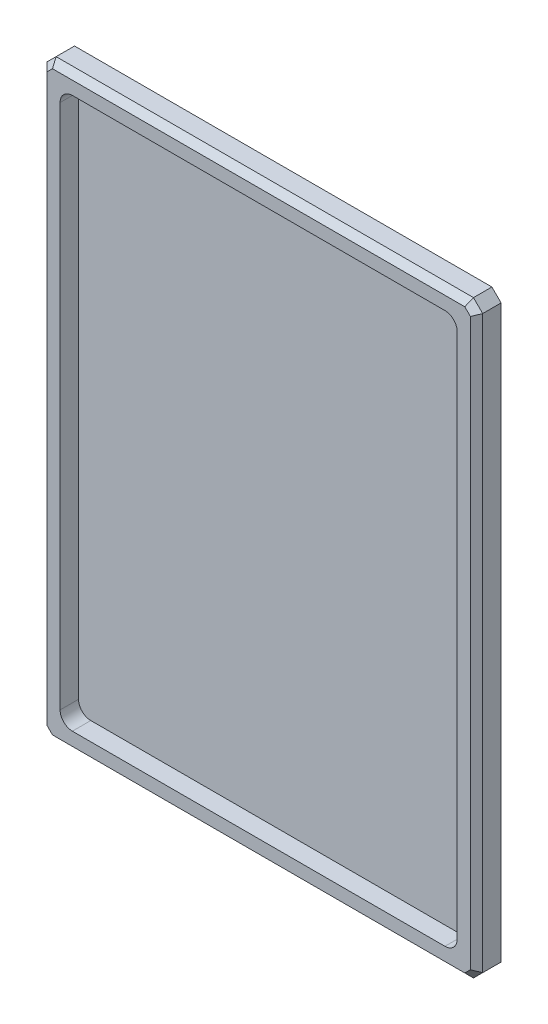
ISO-10303-21;
HEADER;
FILE_DESCRIPTION(('STEP AP214'),'2;1');
FILE_NAME('part.step','',(''),(''),'','','');
FILE_SCHEMA(('AUTOMOTIVE_DESIGN { 1 0 10303 214 1 1 1 1 }'));
ENDSEC;
DATA;
#1=APPLICATION_CONTEXT('core data for automotive mechanical design processes');
#2=APPLICATION_PROTOCOL_DEFINITION('international standard','automotive_design',2000,#1);
#3=PRODUCT_CONTEXT('',#1,'mechanical');
#4=PRODUCT('Part','Part','',(#3));
#5=PRODUCT_RELATED_PRODUCT_CATEGORY('part','',(#4));
#6=PRODUCT_DEFINITION_FORMATION('','',#4);
#7=PRODUCT_DEFINITION_CONTEXT('part definition',#1,'design');
#8=PRODUCT_DEFINITION('design','',#6,#7);
#9=PRODUCT_DEFINITION_SHAPE('','',#8);
#10=(LENGTH_UNIT() NAMED_UNIT(*) SI_UNIT(.MILLI.,.METRE.));
#11=(NAMED_UNIT(*) PLANE_ANGLE_UNIT() SI_UNIT($,.RADIAN.));
#12=(NAMED_UNIT(*) SI_UNIT($,.STERADIAN.) SOLID_ANGLE_UNIT());
#13=UNCERTAINTY_MEASURE_WITH_UNIT(LENGTH_MEASURE(1.E-05),#10,'distance_accuracy_value','');
#14=(GEOMETRIC_REPRESENTATION_CONTEXT(3) GLOBAL_UNCERTAINTY_ASSIGNED_CONTEXT((#13)) GLOBAL_UNIT_ASSIGNED_CONTEXT((#10,
#11,#12)) REPRESENTATION_CONTEXT('',''));
#15=CARTESIAN_POINT('',(0.,0.,0.));
#16=DIRECTION('',(0.,0.,1.));
#17=DIRECTION('',(1.,0.,0.));
#18=AXIS2_PLACEMENT_3D('',#15,#16,#17);
#19=CARTESIAN_POINT('',(-112.7125,-152.4,12.7));
#20=DIRECTION('',(1.,0.,0.));
#21=DIRECTION('',(0.,0.,-1.));
#22=AXIS2_PLACEMENT_3D('',#19,#20,#21);
#23=PLANE('',#22);
#24=DIRECTION('',(0.,0.,1.));
#25=VECTOR('',#24,1.);
#26=CARTESIAN_POINT('',(-112.7125,-147.6375,12.7));
#27=LINE('',#26,#25);
#28=CARTESIAN_POINT('',(-112.7125,-147.6375,0.));
#29=VERTEX_POINT('',#28);
#30=CARTESIAN_POINT('',(-112.7125,-147.6375,9.52499999999996));
#31=VERTEX_POINT('',#30);
#32=EDGE_CURVE('E277',#29,#31,#27,.T.);
#33=ORIENTED_EDGE('',*,*,#32,.T.);
#34=DIRECTION('',(0.,1.,0.));
#35=VECTOR('',#34,1.);
#36=CARTESIAN_POINT('',(-112.7125,147.6375,9.52499999999996));
#37=LINE('',#36,#35);
#38=CARTESIAN_POINT('',(-112.7125,147.6375,9.52499999999996));
#39=VERTEX_POINT('',#38);
#40=EDGE_CURVE('E312',#31,#39,#37,.T.);
#41=ORIENTED_EDGE('',*,*,#40,.T.);
#42=DIRECTION('',(0.,0.,-1.));
#43=VECTOR('',#42,1.);
#44=CARTESIAN_POINT('',(-112.7125,147.6375,12.7));
#45=LINE('',#44,#43);
#46=CARTESIAN_POINT('',(-112.7125,147.6375,0.));
#47=VERTEX_POINT('',#46);
#48=EDGE_CURVE('E275',#39,#47,#45,.T.);
#49=ORIENTED_EDGE('',*,*,#48,.T.);
#50=DIRECTION('',(0.,-1.,0.));
#51=VECTOR('',#50,1.);
#52=CARTESIAN_POINT('',(-112.7125,-152.4,0.));
#53=LINE('',#52,#51);
#54=EDGE_CURVE('E239',#47,#29,#53,.T.);
#55=ORIENTED_EDGE('',*,*,#54,.T.);
#56=EDGE_LOOP('',(#33,#41,#49,#55));
#57=FACE_BOUND('',#56,.T.);
#58=ADVANCED_FACE('F37',(#57),#23,.F.);
#59=CARTESIAN_POINT('',(112.7125,-152.4,12.7));
#60=DIRECTION('',(0.,1.,0.));
#61=DIRECTION('',(0.,0.,1.));
#62=AXIS2_PLACEMENT_3D('',#59,#60,#61);
#63=PLANE('',#62);
#64=DIRECTION('',(0.,0.,1.));
#65=VECTOR('',#64,1.);
#66=CARTESIAN_POINT('',(107.95,-152.4,12.7));
#67=LINE('',#66,#65);
#68=CARTESIAN_POINT('',(107.95,-152.4,0.));
#69=VERTEX_POINT('',#68);
#70=CARTESIAN_POINT('',(107.95,-152.4,9.52499999999996));
#71=VERTEX_POINT('',#70);
#72=EDGE_CURVE('E262',#69,#71,#67,.T.);
#73=ORIENTED_EDGE('',*,*,#72,.T.);
#74=DIRECTION('',(-1.,0.,0.));
#75=VECTOR('',#74,1.);
#76=CARTESIAN_POINT('',(-107.95,-152.4,9.52499999999996));
#77=LINE('',#76,#75);
#78=CARTESIAN_POINT('',(-107.95,-152.4,9.52499999999996));
#79=VERTEX_POINT('',#78);
#80=EDGE_CURVE('E308',#71,#79,#77,.T.);
#81=ORIENTED_EDGE('',*,*,#80,.T.);
#82=DIRECTION('',(0.,0.,-1.));
#83=VECTOR('',#82,1.);
#84=CARTESIAN_POINT('',(-107.95,-152.4,12.7));
#85=LINE('',#84,#83);
#86=CARTESIAN_POINT('',(-107.95,-152.4,0.));
#87=VERTEX_POINT('',#86);
#88=EDGE_CURVE('E265',#79,#87,#85,.T.);
#89=ORIENTED_EDGE('',*,*,#88,.T.);
#90=DIRECTION('',(1.,0.,0.));
#91=VECTOR('',#90,1.);
#92=CARTESIAN_POINT('',(112.7125,-152.4,0.));
#93=LINE('',#92,#91);
#94=EDGE_CURVE('E253',#87,#69,#93,.T.);
#95=ORIENTED_EDGE('',*,*,#94,.T.);
#96=EDGE_LOOP('',(#73,#81,#89,#95));
#97=FACE_BOUND('',#96,.T.);
#98=ADVANCED_FACE('F397',(#97),#63,.F.);
#99=CARTESIAN_POINT('',(112.7125,-152.4,12.7));
#100=DIRECTION('',(-1.,0.,0.));
#101=DIRECTION('',(0.,0.,1.));
#102=AXIS2_PLACEMENT_3D('',#99,#100,#101);
#103=PLANE('',#102);
#104=DIRECTION('',(0.,0.,1.));
#105=VECTOR('',#104,1.);
#106=CARTESIAN_POINT('',(112.7125,147.6375,12.7));
#107=LINE('',#106,#105);
#108=CARTESIAN_POINT('',(112.7125,147.6375,0.));
#109=VERTEX_POINT('',#108);
#110=CARTESIAN_POINT('',(112.7125,147.6375,9.52499999999996));
#111=VERTEX_POINT('',#110);
#112=EDGE_CURVE('E284',#109,#111,#107,.T.);
#113=ORIENTED_EDGE('',*,*,#112,.T.);
#114=DIRECTION('',(0.,-1.,0.));
#115=VECTOR('',#114,1.);
#116=CARTESIAN_POINT('',(112.7125,-147.6375,9.52499999999996));
#117=LINE('',#116,#115);
#118=CARTESIAN_POINT('',(112.7125,-147.6375,9.52499999999996));
#119=VERTEX_POINT('',#118);
#120=EDGE_CURVE('E316',#111,#119,#117,.T.);
#121=ORIENTED_EDGE('',*,*,#120,.T.);
#122=DIRECTION('',(0.,0.,-1.));
#123=VECTOR('',#122,1.);
#124=CARTESIAN_POINT('',(112.7125,-147.6375,12.7));
#125=LINE('',#124,#123);
#126=CARTESIAN_POINT('',(112.7125,-147.6375,0.));
#127=VERTEX_POINT('',#126);
#128=EDGE_CURVE('E286',#119,#127,#125,.T.);
#129=ORIENTED_EDGE('',*,*,#128,.T.);
#130=DIRECTION('',(0.,1.,0.));
#131=VECTOR('',#130,1.);
#132=CARTESIAN_POINT('',(112.7125,-152.4,0.));
#133=LINE('',#132,#131);
#134=EDGE_CURVE('E256',#127,#109,#133,.T.);
#135=ORIENTED_EDGE('',*,*,#134,.T.);
#136=EDGE_LOOP('',(#113,#121,#129,#135));
#137=FACE_BOUND('',#136,.T.);
#138=ADVANCED_FACE('F353',(#137),#103,.F.);
#139=CARTESIAN_POINT('',(112.7125,152.4,12.7));
#140=DIRECTION('',(0.,-1.,0.));
#141=DIRECTION('',(0.,0.,-1.));
#142=AXIS2_PLACEMENT_3D('',#139,#140,#141);
#143=PLANE('',#142);
#144=DIRECTION('',(0.,0.,1.));
#145=VECTOR('',#144,1.);
#146=CARTESIAN_POINT('',(-107.95,152.4,12.7));
#147=LINE('',#146,#145);
#148=CARTESIAN_POINT('',(-107.95,152.4,0.));
#149=VERTEX_POINT('',#148);
#150=CARTESIAN_POINT('',(-107.95,152.4,9.52499999999996));
#151=VERTEX_POINT('',#150);
#152=EDGE_CURVE('E282',#149,#151,#147,.T.);
#153=ORIENTED_EDGE('',*,*,#152,.T.);
#154=DIRECTION('',(1.,0.,0.));
#155=VECTOR('',#154,1.);
#156=CARTESIAN_POINT('',(107.95,152.4,9.52499999999996));
#157=LINE('',#156,#155);
#158=CARTESIAN_POINT('',(107.95,152.4,9.52499999999996));
#159=VERTEX_POINT('',#158);
#160=EDGE_CURVE('E11',#151,#159,#157,.T.);
#161=ORIENTED_EDGE('',*,*,#160,.T.);
#162=DIRECTION('',(0.,0.,-1.));
#163=VECTOR('',#162,1.);
#164=CARTESIAN_POINT('',(107.95,152.4,12.7));
#165=LINE('',#164,#163);
#166=CARTESIAN_POINT('',(107.95,152.4,0.));
#167=VERTEX_POINT('',#166);
#168=EDGE_CURVE('E280',#159,#167,#165,.T.);
#169=ORIENTED_EDGE('',*,*,#168,.T.);
#170=DIRECTION('',(-1.,0.,0.));
#171=VECTOR('',#170,1.);
#172=CARTESIAN_POINT('',(112.7125,152.4,0.));
#173=LINE('',#172,#171);
#174=EDGE_CURVE('E259',#167,#149,#173,.T.);
#175=ORIENTED_EDGE('',*,*,#174,.T.);
#176=EDGE_LOOP('',(#153,#161,#169,#175));
#177=FACE_BOUND('',#176,.T.);
#178=ADVANCED_FACE('F368',(#177),#143,.F.);
#179=CARTESIAN_POINT('',(0.,0.,12.7));
#180=DIRECTION('',(0.,0.,1.));
#181=DIRECTION('',(1.,0.,0.));
#182=AXIS2_PLACEMENT_3D('',#179,#180,#181);
#183=PLANE('',#182);
#184=DIRECTION('',(0.,-1.,0.));
#185=VECTOR('',#184,1.);
#186=CARTESIAN_POINT('',(-109.5375,-147.6375,12.7));
#187=LINE('',#186,#185);
#188=CARTESIAN_POINT('',(-109.5375,146.322371939465,12.7));
#189=VERTEX_POINT('',#188);
#190=CARTESIAN_POINT('',(-109.5375,-146.322371939465,12.7));
#191=VERTEX_POINT('',#190);
#192=EDGE_CURVE('E296',#189,#191,#187,.T.);
#193=ORIENTED_EDGE('',*,*,#192,.T.);
#194=DIRECTION('',(0.707106781186548,-0.707106781186548,0.));
#195=VECTOR('',#194,1.);
#196=CARTESIAN_POINT('',(-127.929935969733,-127.929935969733,12.7));
#197=LINE('',#196,#195);
#198=CARTESIAN_POINT('',(-106.634871939465,-149.225,12.7));
#199=VERTEX_POINT('',#198);
#200=EDGE_CURVE('E302',#191,#199,#197,.T.);
#201=ORIENTED_EDGE('',*,*,#200,.T.);
#202=DIRECTION('',(1.,0.,0.));
#203=VECTOR('',#202,1.);
#204=CARTESIAN_POINT('',(107.95,-149.225,12.7));
#205=LINE('',#204,#203);
#206=CARTESIAN_POINT('',(106.634871939465,-149.225,12.7));
#207=VERTEX_POINT('',#206);
#208=EDGE_CURVE('E300',#199,#207,#205,.T.);
#209=ORIENTED_EDGE('',*,*,#208,.T.);
#210=DIRECTION('',(0.707106781186548,0.707106781186548,0.));
#211=VECTOR('',#210,1.);
#212=CARTESIAN_POINT('',(127.929935969733,-127.929935969733,12.7));
#213=LINE('',#212,#211);
#214=CARTESIAN_POINT('',(109.5375,-146.322371939465,12.7));
#215=VERTEX_POINT('',#214);
#216=EDGE_CURVE('E298',#207,#215,#213,.T.);
#217=ORIENTED_EDGE('',*,*,#216,.T.);
#218=DIRECTION('',(0.,1.,0.));
#219=VECTOR('',#218,1.);
#220=CARTESIAN_POINT('',(109.5375,147.6375,12.7));
#221=LINE('',#220,#219);
#222=CARTESIAN_POINT('',(109.5375,146.322371939465,12.7));
#223=VERTEX_POINT('',#222);
#224=EDGE_CURVE('E292',#215,#223,#221,.T.);
#225=ORIENTED_EDGE('',*,*,#224,.T.);
#226=DIRECTION('',(-0.707106781186548,0.707106781186548,0.));
#227=VECTOR('',#226,1.);
#228=CARTESIAN_POINT('',(127.929935969733,127.929935969733,12.7));
#229=LINE('',#228,#227);
#230=CARTESIAN_POINT('',(106.634871939465,149.225,12.7));
#231=VERTEX_POINT('',#230);
#232=EDGE_CURVE('E290',#223,#231,#229,.T.);
#233=ORIENTED_EDGE('',*,*,#232,.T.);
#234=DIRECTION('',(-1.,0.,0.));
#235=VECTOR('',#234,1.);
#236=CARTESIAN_POINT('',(-107.95,149.225,12.7));
#237=LINE('',#236,#235);
#238=CARTESIAN_POINT('',(-106.634871939465,149.225,12.7));
#239=VERTEX_POINT('',#238);
#240=EDGE_CURVE('E288',#231,#239,#237,.T.);
#241=ORIENTED_EDGE('',*,*,#240,.T.);
#242=DIRECTION('',(-0.707106781186552,-0.707106781186543,0.));
#243=VECTOR('',#242,1.);
#244=CARTESIAN_POINT('',(-127.929935969732,127.929935969734,12.7));
#245=LINE('',#244,#243);
#246=EDGE_CURVE('E294',#239,#189,#245,.T.);
#247=ORIENTED_EDGE('',*,*,#246,.T.);
#248=EDGE_LOOP('',(#193,#201,#209,#217,#225,#233,#241,#247));
#249=FACE_BOUND('',#248,.T.);
#250=CARTESIAN_POINT('',(-96.3625,-136.05,12.7));
#251=DIRECTION('',(0.,0.,1.));
#252=DIRECTION('',(-1.,0.,0.));
#253=AXIS2_PLACEMENT_3D('',#250,#251,#252);
#254=CIRCLE('',#253,6.34999999999999);
#255=CARTESIAN_POINT('',(-102.7125,-136.05,12.7));
#256=VERTEX_POINT('',#255);
#257=CARTESIAN_POINT('',(-96.3625,-142.4,12.7));
#258=VERTEX_POINT('',#257);
#259=EDGE_CURVE('E183',#256,#258,#254,.T.);
#260=ORIENTED_EDGE('',*,*,#259,.F.);
#261=DIRECTION('',(0.,-1.,0.));
#262=VECTOR('',#261,1.);
#263=CARTESIAN_POINT('',(-102.7125,-136.05,12.7));
#264=LINE('',#263,#262);
#265=CARTESIAN_POINT('',(-102.7125,136.05,12.7));
#266=VERTEX_POINT('',#265);
#267=EDGE_CURVE('E201',#266,#256,#264,.T.);
#268=ORIENTED_EDGE('',*,*,#267,.F.);
#269=CARTESIAN_POINT('',(-96.3625,136.05,12.7));
#270=DIRECTION('',(0.,0.,1.));
#271=DIRECTION('',(1.,0.,0.));
#272=AXIS2_PLACEMENT_3D('',#269,#270,#271);
#273=CIRCLE('',#272,6.34999999999999);
#274=CARTESIAN_POINT('',(-96.3625,142.4,12.7));
#275=VERTEX_POINT('',#274);
#276=EDGE_CURVE('E204',#275,#266,#273,.T.);
#277=ORIENTED_EDGE('',*,*,#276,.F.);
#278=DIRECTION('',(-1.,0.,0.));
#279=VECTOR('',#278,1.);
#280=CARTESIAN_POINT('',(96.3625,142.4,12.7));
#281=LINE('',#280,#279);
#282=CARTESIAN_POINT('',(96.3625,142.4,12.7));
#283=VERTEX_POINT('',#282);
#284=EDGE_CURVE('E232',#283,#275,#281,.T.);
#285=ORIENTED_EDGE('',*,*,#284,.F.);
#286=CARTESIAN_POINT('',(96.3625,136.05,12.7));
#287=DIRECTION('',(0.,0.,1.));
#288=DIRECTION('',(1.,0.,0.));
#289=AXIS2_PLACEMENT_3D('',#286,#287,#288);
#290=CIRCLE('',#289,6.34999999999997);
#291=CARTESIAN_POINT('',(102.7125,136.05,12.7));
#292=VERTEX_POINT('',#291);
#293=EDGE_CURVE('E229',#292,#283,#290,.T.);
#294=ORIENTED_EDGE('',*,*,#293,.F.);
#295=DIRECTION('',(0.,1.,0.));
#296=VECTOR('',#295,1.);
#297=CARTESIAN_POINT('',(102.7125,-136.05,12.7));
#298=LINE('',#297,#296);
#299=CARTESIAN_POINT('',(102.7125,-136.05,12.7));
#300=VERTEX_POINT('',#299);
#301=EDGE_CURVE('E226',#300,#292,#298,.T.);
#302=ORIENTED_EDGE('',*,*,#301,.F.);
#303=CARTESIAN_POINT('',(96.3625,-136.05,12.7));
#304=DIRECTION('',(0.,0.,1.));
#305=DIRECTION('',(1.,0.,0.));
#306=AXIS2_PLACEMENT_3D('',#303,#304,#305);
#307=CIRCLE('',#306,6.34999999999999);
#308=CARTESIAN_POINT('',(96.3625,-142.4,12.7));
#309=VERTEX_POINT('',#308);
#310=EDGE_CURVE('E223',#309,#300,#307,.T.);
#311=ORIENTED_EDGE('',*,*,#310,.F.);
#312=DIRECTION('',(1.,0.,0.));
#313=VECTOR('',#312,1.);
#314=CARTESIAN_POINT('',(96.3625,-142.4,12.7));
#315=LINE('',#314,#313);
#316=EDGE_CURVE('E221',#258,#309,#315,.T.);
#317=ORIENTED_EDGE('',*,*,#316,.F.);
#318=EDGE_LOOP('',(#260,#268,#277,#285,#294,#302,#311,#317));
#319=FACE_BOUND('',#318,.T.);
#320=ADVANCED_FACE('F384',(#249,#319),#183,.T.);
#321=CARTESIAN_POINT('',(0.,0.,0.));
#322=DIRECTION('',(0.,0.,1.));
#323=DIRECTION('',(1.,0.,0.));
#324=AXIS2_PLACEMENT_3D('',#321,#322,#323);
#325=PLANE('',#324);
#326=ORIENTED_EDGE('',*,*,#94,.F.);
#327=DIRECTION('',(0.707106781186548,-0.707106781186548,0.));
#328=VECTOR('',#327,1.);
#329=CARTESIAN_POINT('',(-107.95,-152.4,0.));
#330=LINE('',#329,#328);
#331=EDGE_CURVE('E273',#87,#29,#330,.F.);
#332=ORIENTED_EDGE('',*,*,#331,.T.);
#333=ORIENTED_EDGE('',*,*,#54,.F.);
#334=DIRECTION('',(-0.707106781186552,-0.707106781186543,0.));
#335=VECTOR('',#334,1.);
#336=CARTESIAN_POINT('',(-112.7125,147.6375,0.));
#337=LINE('',#336,#335);
#338=EDGE_CURVE('E271',#47,#149,#337,.F.);
#339=ORIENTED_EDGE('',*,*,#338,.T.);
#340=ORIENTED_EDGE('',*,*,#174,.F.);
#341=DIRECTION('',(-0.707106781186548,0.707106781186548,0.));
#342=VECTOR('',#341,1.);
#343=CARTESIAN_POINT('',(107.95,152.4,0.));
#344=LINE('',#343,#342);
#345=EDGE_CURVE('E267',#167,#109,#344,.F.);
#346=ORIENTED_EDGE('',*,*,#345,.T.);
#347=ORIENTED_EDGE('',*,*,#134,.F.);
#348=DIRECTION('',(0.707106781186548,0.707106781186548,0.));
#349=VECTOR('',#348,1.);
#350=CARTESIAN_POINT('',(112.7125,-147.6375,0.));
#351=LINE('',#350,#349);
#352=EDGE_CURVE('E269',#127,#69,#351,.F.);
#353=ORIENTED_EDGE('',*,*,#352,.T.);
#354=EDGE_LOOP('',(#326,#332,#333,#339,#340,#346,#347,#353));
#355=FACE_BOUND('',#354,.T.);
#356=ADVANCED_FACE('F361',(#355),#325,.F.);
#357=CARTESIAN_POINT('',(-96.3625,-136.05,3.175));
#358=DIRECTION('',(0.,0.,1.));
#359=DIRECTION('',(1.,0.,0.));
#360=AXIS2_PLACEMENT_3D('',#357,#358,#359);
#361=CYLINDRICAL_SURFACE('',#360,6.34999999999999);
#362=ORIENTED_EDGE('',*,*,#259,.T.);
#363=DIRECTION('',(0.,0.,1.));
#364=VECTOR('',#363,1.);
#365=CARTESIAN_POINT('',(-96.3625,-142.4,3.175));
#366=LINE('',#365,#364);
#367=CARTESIAN_POINT('',(-96.3625,-142.4,3.175));
#368=VERTEX_POINT('',#367);
#369=EDGE_CURVE('E176',#368,#258,#366,.T.);
#370=ORIENTED_EDGE('',*,*,#369,.F.);
#371=CARTESIAN_POINT('',(-96.3625,-136.05,3.175));
#372=DIRECTION('',(0.,0.,1.));
#373=DIRECTION('',(-1.,0.,0.));
#374=AXIS2_PLACEMENT_3D('',#371,#372,#373);
#375=CIRCLE('',#374,6.34999999999999);
#376=CARTESIAN_POINT('',(-102.7125,-136.05,3.175));
#377=VERTEX_POINT('',#376);
#378=EDGE_CURVE('E180',#377,#368,#375,.T.);
#379=ORIENTED_EDGE('',*,*,#378,.F.);
#380=DIRECTION('',(0.,0.,1.));
#381=VECTOR('',#380,1.);
#382=CARTESIAN_POINT('',(-102.7125,-136.05,3.175));
#383=LINE('',#382,#381);
#384=EDGE_CURVE('E237',#377,#256,#383,.T.);
#385=ORIENTED_EDGE('',*,*,#384,.T.);
#386=EDGE_LOOP('',(#362,#370,#379,#385));
#387=FACE_BOUND('',#386,.T.);
#388=ADVANCED_FACE('F178',(#387),#361,.F.);
#389=CARTESIAN_POINT('',(-102.7125,-136.05,3.175));
#390=DIRECTION('',(-1.,0.,0.));
#391=DIRECTION('',(0.,-1.,0.));
#392=AXIS2_PLACEMENT_3D('',#389,#390,#391);
#393=PLANE('',#392);
#394=ORIENTED_EDGE('',*,*,#267,.T.);
#395=ORIENTED_EDGE('',*,*,#384,.F.);
#396=DIRECTION('',(0.,-1.,0.));
#397=VECTOR('',#396,1.);
#398=CARTESIAN_POINT('',(-102.7125,-136.05,3.175));
#399=LINE('',#398,#397);
#400=CARTESIAN_POINT('',(-102.7125,136.05,3.175));
#401=VERTEX_POINT('',#400);
#402=EDGE_CURVE('E188',#401,#377,#399,.T.);
#403=ORIENTED_EDGE('',*,*,#402,.F.);
#404=DIRECTION('',(0.,0.,1.));
#405=VECTOR('',#404,1.);
#406=CARTESIAN_POINT('',(-102.7125,136.05,3.175));
#407=LINE('',#406,#405);
#408=EDGE_CURVE('E240',#401,#266,#407,.T.);
#409=ORIENTED_EDGE('',*,*,#408,.T.);
#410=EDGE_LOOP('',(#394,#395,#403,#409));
#411=FACE_BOUND('',#410,.T.);
#412=ADVANCED_FACE('F594',(#411),#393,.F.);
#413=CARTESIAN_POINT('',(-96.3625,136.05,3.175));
#414=DIRECTION('',(0.,0.,1.));
#415=DIRECTION('',(1.,0.,0.));
#416=AXIS2_PLACEMENT_3D('',#413,#414,#415);
#417=CYLINDRICAL_SURFACE('',#416,6.34999999999999);
#418=ORIENTED_EDGE('',*,*,#276,.T.);
#419=ORIENTED_EDGE('',*,*,#408,.F.);
#420=CARTESIAN_POINT('',(-96.3625,136.05,3.175));
#421=DIRECTION('',(0.,0.,1.));
#422=DIRECTION('',(1.,0.,0.));
#423=AXIS2_PLACEMENT_3D('',#420,#421,#422);
#424=CIRCLE('',#423,6.34999999999999);
#425=CARTESIAN_POINT('',(-96.3625,142.4,3.175));
#426=VERTEX_POINT('',#425);
#427=EDGE_CURVE('E217',#426,#401,#424,.T.);
#428=ORIENTED_EDGE('',*,*,#427,.F.);
#429=DIRECTION('',(0.,0.,1.));
#430=VECTOR('',#429,1.);
#431=CARTESIAN_POINT('',(-96.3625,142.4,3.175));
#432=LINE('',#431,#430);
#433=EDGE_CURVE('E242',#426,#275,#432,.T.);
#434=ORIENTED_EDGE('',*,*,#433,.T.);
#435=EDGE_LOOP('',(#418,#419,#428,#434));
#436=FACE_BOUND('',#435,.T.);
#437=ADVANCED_FACE('F585',(#436),#417,.F.);
#438=CARTESIAN_POINT('',(96.3625,142.4,3.175));
#439=DIRECTION('',(0.,1.,0.));
#440=DIRECTION('',(0.,0.,1.));
#441=AXIS2_PLACEMENT_3D('',#438,#439,#440);
#442=PLANE('',#441);
#443=ORIENTED_EDGE('',*,*,#284,.T.);
#444=ORIENTED_EDGE('',*,*,#433,.F.);
#445=DIRECTION('',(-1.,0.,0.));
#446=VECTOR('',#445,1.);
#447=CARTESIAN_POINT('',(96.3625,142.4,3.175));
#448=LINE('',#447,#446);
#449=CARTESIAN_POINT('',(96.3625,142.4,3.175));
#450=VERTEX_POINT('',#449);
#451=EDGE_CURVE('E214',#450,#426,#448,.T.);
#452=ORIENTED_EDGE('',*,*,#451,.F.);
#453=DIRECTION('',(0.,0.,1.));
#454=VECTOR('',#453,1.);
#455=CARTESIAN_POINT('',(96.3625,142.4,3.175));
#456=LINE('',#455,#454);
#457=EDGE_CURVE('E244',#450,#283,#456,.T.);
#458=ORIENTED_EDGE('',*,*,#457,.T.);
#459=EDGE_LOOP('',(#443,#444,#452,#458));
#460=FACE_BOUND('',#459,.T.);
#461=ADVANCED_FACE('F576',(#460),#442,.F.);
#462=CARTESIAN_POINT('',(96.3625,136.05,3.175));
#463=DIRECTION('',(0.,0.,1.));
#464=DIRECTION('',(1.,0.,0.));
#465=AXIS2_PLACEMENT_3D('',#462,#463,#464);
#466=CYLINDRICAL_SURFACE('',#465,6.34999999999997);
#467=ORIENTED_EDGE('',*,*,#293,.T.);
#468=ORIENTED_EDGE('',*,*,#457,.F.);
#469=CARTESIAN_POINT('',(96.3625,136.05,3.175));
#470=DIRECTION('',(0.,0.,1.));
#471=DIRECTION('',(1.,0.,0.));
#472=AXIS2_PLACEMENT_3D('',#469,#470,#471);
#473=CIRCLE('',#472,6.34999999999997);
#474=CARTESIAN_POINT('',(102.7125,136.05,3.175));
#475=VERTEX_POINT('',#474);
#476=EDGE_CURVE('E211',#475,#450,#473,.T.);
#477=ORIENTED_EDGE('',*,*,#476,.F.);
#478=DIRECTION('',(0.,0.,1.));
#479=VECTOR('',#478,1.);
#480=CARTESIAN_POINT('',(102.7125,136.05,3.175));
#481=LINE('',#480,#479);
#482=EDGE_CURVE('E246',#475,#292,#481,.T.);
#483=ORIENTED_EDGE('',*,*,#482,.T.);
#484=EDGE_LOOP('',(#467,#468,#477,#483));
#485=FACE_BOUND('',#484,.T.);
#486=ADVANCED_FACE('F567',(#485),#466,.F.);
#487=CARTESIAN_POINT('',(102.7125,-136.05,3.175));
#488=DIRECTION('',(1.,0.,0.));
#489=DIRECTION('',(0.,0.,-1.));
#490=AXIS2_PLACEMENT_3D('',#487,#488,#489);
#491=PLANE('',#490);
#492=ORIENTED_EDGE('',*,*,#301,.T.);
#493=ORIENTED_EDGE('',*,*,#482,.F.);
#494=DIRECTION('',(0.,1.,0.));
#495=VECTOR('',#494,1.);
#496=CARTESIAN_POINT('',(102.7125,-136.05,3.175));
#497=LINE('',#496,#495);
#498=CARTESIAN_POINT('',(102.7125,-136.05,3.175));
#499=VERTEX_POINT('',#498);
#500=EDGE_CURVE('E208',#499,#475,#497,.T.);
#501=ORIENTED_EDGE('',*,*,#500,.F.);
#502=DIRECTION('',(0.,0.,1.));
#503=VECTOR('',#502,1.);
#504=CARTESIAN_POINT('',(102.7125,-136.05,3.175));
#505=LINE('',#504,#503);
#506=EDGE_CURVE('E248',#499,#300,#505,.T.);
#507=ORIENTED_EDGE('',*,*,#506,.T.);
#508=EDGE_LOOP('',(#492,#493,#501,#507));
#509=FACE_BOUND('',#508,.T.);
#510=ADVANCED_FACE('F558',(#509),#491,.F.);
#511=CARTESIAN_POINT('',(96.3625,-136.05,3.175));
#512=DIRECTION('',(0.,0.,1.));
#513=DIRECTION('',(1.,0.,0.));
#514=AXIS2_PLACEMENT_3D('',#511,#512,#513);
#515=CYLINDRICAL_SURFACE('',#514,6.34999999999999);
#516=ORIENTED_EDGE('',*,*,#310,.T.);
#517=ORIENTED_EDGE('',*,*,#506,.F.);
#518=CARTESIAN_POINT('',(96.3625,-136.05,3.175));
#519=DIRECTION('',(0.,0.,1.));
#520=DIRECTION('',(1.,0.,0.));
#521=AXIS2_PLACEMENT_3D('',#518,#519,#520);
#522=CIRCLE('',#521,6.34999999999999);
#523=CARTESIAN_POINT('',(96.3625,-142.4,3.175));
#524=VERTEX_POINT('',#523);
#525=EDGE_CURVE('E196',#524,#499,#522,.T.);
#526=ORIENTED_EDGE('',*,*,#525,.F.);
#527=DIRECTION('',(0.,0.,1.));
#528=VECTOR('',#527,1.);
#529=CARTESIAN_POINT('',(96.3625,-142.4,3.175));
#530=LINE('',#529,#528);
#531=EDGE_CURVE('E187',#524,#309,#530,.T.);
#532=ORIENTED_EDGE('',*,*,#531,.T.);
#533=EDGE_LOOP('',(#516,#517,#526,#532));
#534=FACE_BOUND('',#533,.T.);
#535=ADVANCED_FACE('F550',(#534),#515,.F.);
#536=CARTESIAN_POINT('',(96.3625,-142.4,3.175));
#537=DIRECTION('',(0.,-1.,0.));
#538=DIRECTION('',(0.,0.,-1.));
#539=AXIS2_PLACEMENT_3D('',#536,#537,#538);
#540=PLANE('',#539);
#541=ORIENTED_EDGE('',*,*,#316,.T.);
#542=ORIENTED_EDGE('',*,*,#531,.F.);
#543=DIRECTION('',(1.,0.,0.));
#544=VECTOR('',#543,1.);
#545=CARTESIAN_POINT('',(96.3625,-142.4,3.175));
#546=LINE('',#545,#544);
#547=EDGE_CURVE('E191',#368,#524,#546,.T.);
#548=ORIENTED_EDGE('',*,*,#547,.F.);
#549=ORIENTED_EDGE('',*,*,#369,.T.);
#550=EDGE_LOOP('',(#541,#542,#548,#549));
#551=FACE_BOUND('',#550,.T.);
#552=ADVANCED_FACE('F192',(#551),#540,.F.);
#553=CARTESIAN_POINT('',(-96.3625,-136.05,3.175));
#554=DIRECTION('',(0.,0.,-1.));
#555=DIRECTION('',(-1.,0.,0.));
#556=AXIS2_PLACEMENT_3D('',#553,#554,#555);
#557=PLANE('',#556);
#558=ORIENTED_EDGE('',*,*,#378,.T.);
#559=ORIENTED_EDGE('',*,*,#547,.T.);
#560=ORIENTED_EDGE('',*,*,#525,.T.);
#561=ORIENTED_EDGE('',*,*,#500,.T.);
#562=ORIENTED_EDGE('',*,*,#476,.T.);
#563=ORIENTED_EDGE('',*,*,#451,.T.);
#564=ORIENTED_EDGE('',*,*,#427,.T.);
#565=ORIENTED_EDGE('',*,*,#402,.T.);
#566=EDGE_LOOP('',(#558,#559,#560,#561,#562,#563,#564,#565));
#567=FACE_BOUND('',#566,.T.);
#568=ADVANCED_FACE('F198',(#567),#557,.F.);
#569=CARTESIAN_POINT('',(-107.95,-152.4,12.7));
#570=DIRECTION('',(0.707106781186547,0.707106781186547,0.));
#571=DIRECTION('',(0.,0.,-1.));
#572=AXIS2_PLACEMENT_3D('',#569,#570,#571);
#573=PLANE('',#572);
#574=ORIENTED_EDGE('',*,*,#88,.F.);
#575=DIRECTION('',(0.707106781186548,-0.707106781186548,0.));
#576=VECTOR('',#575,1.);
#577=CARTESIAN_POINT('',(-107.95,-152.4,9.52499999999996));
#578=LINE('',#577,#576);
#579=EDGE_CURVE('E305',#79,#31,#578,.F.);
#580=ORIENTED_EDGE('',*,*,#579,.T.);
#581=ORIENTED_EDGE('',*,*,#32,.F.);
#582=ORIENTED_EDGE('',*,*,#331,.F.);
#583=EDGE_LOOP('',(#574,#580,#581,#582));
#584=FACE_BOUND('',#583,.T.);
#585=ADVANCED_FACE('F401',(#584),#573,.F.);
#586=CARTESIAN_POINT('',(-112.7125,147.6375,12.7));
#587=DIRECTION('',(0.707106781186543,-0.707106781186552,0.));
#588=DIRECTION('',(0.,0.,-1.));
#589=AXIS2_PLACEMENT_3D('',#586,#587,#588);
#590=PLANE('',#589);
#591=ORIENTED_EDGE('',*,*,#48,.F.);
#592=DIRECTION('',(-0.707106781186552,-0.707106781186543,0.));
#593=VECTOR('',#592,1.);
#594=CARTESIAN_POINT('',(-112.7125,147.6375,9.52499999999996));
#595=LINE('',#594,#593);
#596=EDGE_CURVE('E314',#39,#151,#595,.F.);
#597=ORIENTED_EDGE('',*,*,#596,.T.);
#598=ORIENTED_EDGE('',*,*,#152,.F.);
#599=ORIENTED_EDGE('',*,*,#338,.F.);
#600=EDGE_LOOP('',(#591,#597,#598,#599));
#601=FACE_BOUND('',#600,.T.);
#602=ADVANCED_FACE('F371',(#601),#590,.F.);
#603=CARTESIAN_POINT('',(112.7125,-147.6375,12.7));
#604=DIRECTION('',(-0.707106781186547,0.707106781186547,0.));
#605=DIRECTION('',(0.,0.,-1.));
#606=AXIS2_PLACEMENT_3D('',#603,#604,#605);
#607=PLANE('',#606);
#608=ORIENTED_EDGE('',*,*,#128,.F.);
#609=DIRECTION('',(0.707106781186548,0.707106781186548,0.));
#610=VECTOR('',#609,1.);
#611=CARTESIAN_POINT('',(112.7125,-147.6375,9.52499999999996));
#612=LINE('',#611,#610);
#613=EDGE_CURVE('E310',#119,#71,#612,.F.);
#614=ORIENTED_EDGE('',*,*,#613,.T.);
#615=ORIENTED_EDGE('',*,*,#72,.F.);
#616=ORIENTED_EDGE('',*,*,#352,.F.);
#617=EDGE_LOOP('',(#608,#614,#615,#616));
#618=FACE_BOUND('',#617,.T.);
#619=ADVANCED_FACE('F356',(#618),#607,.F.);
#620=CARTESIAN_POINT('',(107.95,152.4,12.7));
#621=DIRECTION('',(-0.707106781186547,-0.707106781186547,0.));
#622=DIRECTION('',(0.,0.,-1.));
#623=AXIS2_PLACEMENT_3D('',#620,#621,#622);
#624=PLANE('',#623);
#625=ORIENTED_EDGE('',*,*,#168,.F.);
#626=DIRECTION('',(-0.707106781186548,0.707106781186548,0.));
#627=VECTOR('',#626,1.);
#628=CARTESIAN_POINT('',(107.95,152.4,9.52499999999996));
#629=LINE('',#628,#627);
#630=EDGE_CURVE('E47',#159,#111,#629,.F.);
#631=ORIENTED_EDGE('',*,*,#630,.T.);
#632=ORIENTED_EDGE('',*,*,#112,.F.);
#633=ORIENTED_EDGE('',*,*,#345,.F.);
#634=EDGE_LOOP('',(#625,#631,#632,#633));
#635=FACE_BOUND('',#634,.T.);
#636=ADVANCED_FACE('F364',(#635),#624,.F.);
#637=CARTESIAN_POINT('',(127.929935969733,127.929935969733,12.7));
#638=DIRECTION('',(0.5,0.5,0.707106781186547));
#639=DIRECTION('',(0.707106781186548,-0.707106781186548,0.));
#640=AXIS2_PLACEMENT_3D('',#637,#638,#639);
#641=PLANE('',#640);
#642=DIRECTION('',(0.678598344545847,0.28108463771482,-0.678598344545847));
#643=VECTOR('',#642,1.);
#644=CARTESIAN_POINT('',(114.498899024995,148.377450703963,7.73860097500461));
#645=LINE('',#644,#643);
#646=EDGE_CURVE('E334',#111,#223,#645,.F.);
#647=ORIENTED_EDGE('',*,*,#646,.F.);
#648=ORIENTED_EDGE('',*,*,#630,.F.);
#649=DIRECTION('',(0.28108463771482,0.678598344545847,-0.678598344545847));
#650=VECTOR('',#649,1.);
#651=CARTESIAN_POINT('',(98.2098028158527,128.885083857843,33.0399161421567));
#652=LINE('',#651,#650);
#653=EDGE_CURVE('E42',#231,#159,#652,.T.);
#654=ORIENTED_EDGE('',*,*,#653,.F.);
#655=ORIENTED_EDGE('',*,*,#232,.F.);
#656=EDGE_LOOP('',(#647,#648,#654,#655));
#657=FACE_BOUND('',#656,.T.);
#658=ADVANCED_FACE('F40',(#657),#641,.T.);
#659=CARTESIAN_POINT('',(0.,149.225,12.7));
#660=DIRECTION('',(0.,0.707106781186548,0.707106781186548));
#661=DIRECTION('',(1.,0.,0.));
#662=AXIS2_PLACEMENT_3D('',#659,#660,#661);
#663=PLANE('',#662);
#664=ORIENTED_EDGE('',*,*,#653,.T.);
#665=ORIENTED_EDGE('',*,*,#160,.F.);
#666=DIRECTION('',(0.28108463771482,-0.678598344545847,0.678598344545847));
#667=VECTOR('',#666,1.);
#668=CARTESIAN_POINT('',(-98.2098028158526,128.885083857843,33.0399161421567));
#669=LINE('',#668,#667);
#670=EDGE_CURVE('E332',#239,#151,#669,.F.);
#671=ORIENTED_EDGE('',*,*,#670,.F.);
#672=ORIENTED_EDGE('',*,*,#240,.F.);
#673=EDGE_LOOP('',(#664,#665,#671,#672));
#674=FACE_BOUND('',#673,.T.);
#675=ADVANCED_FACE('F344',(#674),#663,.T.);
#676=CARTESIAN_POINT('',(109.5375,0.,12.7));
#677=DIRECTION('',(0.707106781186548,0.,0.707106781186548));
#678=DIRECTION('',(0.,-1.,0.));
#679=AXIS2_PLACEMENT_3D('',#676,#677,#678);
#680=PLANE('',#679);
#681=ORIENTED_EDGE('',*,*,#646,.T.);
#682=ORIENTED_EDGE('',*,*,#224,.F.);
#683=DIRECTION('',(0.678598344545847,-0.28108463771482,-0.678598344545847));
#684=VECTOR('',#683,1.);
#685=CARTESIAN_POINT('',(81.6274484301935,-134.761650052719,40.6100515698065));
#686=LINE('',#685,#684);
#687=EDGE_CURVE('E329',#119,#215,#686,.F.);
#688=ORIENTED_EDGE('',*,*,#687,.F.);
#689=ORIENTED_EDGE('',*,*,#120,.F.);
#690=EDGE_LOOP('',(#681,#682,#688,#689));
#691=FACE_BOUND('',#690,.T.);
#692=ADVANCED_FACE('F349',(#691),#680,.T.);
#693=CARTESIAN_POINT('',(-127.929935969732,127.929935969734,12.7));
#694=DIRECTION('',(-0.499999999999997,0.500000000000002,0.707106781186548));
#695=DIRECTION('',(0.707106781186552,0.707106781186543,0.));
#696=AXIS2_PLACEMENT_3D('',#693,#694,#695);
#697=PLANE('',#696);
#698=ORIENTED_EDGE('',*,*,#670,.T.);
#699=ORIENTED_EDGE('',*,*,#596,.F.);
#700=DIRECTION('',(0.678598344545846,-0.281084637714824,0.678598344545846));
#701=VECTOR('',#700,1.);
#702=CARTESIAN_POINT('',(-114.498899024995,148.377450703963,7.73860097500483));
#703=LINE('',#702,#701);
#704=EDGE_CURVE('E326',#189,#39,#703,.F.);
#705=ORIENTED_EDGE('',*,*,#704,.F.);
#706=ORIENTED_EDGE('',*,*,#246,.F.);
#707=EDGE_LOOP('',(#698,#699,#705,#706));
#708=FACE_BOUND('',#707,.T.);
#709=ADVANCED_FACE('F375',(#708),#697,.T.);
#710=CARTESIAN_POINT('',(127.929935969733,-127.929935969733,12.7));
#711=DIRECTION('',(0.5,-0.5,0.707106781186547));
#712=DIRECTION('',(-0.707106781186548,-0.707106781186548,0.));
#713=AXIS2_PLACEMENT_3D('',#710,#711,#712);
#714=PLANE('',#713);
#715=ORIENTED_EDGE('',*,*,#687,.T.);
#716=ORIENTED_EDGE('',*,*,#216,.F.);
#717=DIRECTION('',(0.28108463771482,-0.678598344545847,-0.678598344545847));
#718=VECTOR('',#717,1.);
#719=CARTESIAN_POINT('',(104.255468039447,-143.480610834212,18.444389165788));
#720=LINE('',#719,#718);
#721=EDGE_CURVE('E323',#71,#207,#720,.F.);
#722=ORIENTED_EDGE('',*,*,#721,.F.);
#723=ORIENTED_EDGE('',*,*,#613,.F.);
#724=EDGE_LOOP('',(#715,#716,#722,#723));
#725=FACE_BOUND('',#724,.T.);
#726=ADVANCED_FACE('F388',(#725),#714,.T.);
#727=CARTESIAN_POINT('',(-109.5375,0.,12.7));
#728=DIRECTION('',(-0.707106781186548,0.,0.707106781186548));
#729=DIRECTION('',(0.,1.,0.));
#730=AXIS2_PLACEMENT_3D('',#727,#728,#729);
#731=PLANE('',#730);
#732=ORIENTED_EDGE('',*,*,#704,.T.);
#733=ORIENTED_EDGE('',*,*,#40,.F.);
#734=DIRECTION('',(0.678598344545847,0.28108463771482,0.678598344545847));
#735=VECTOR('',#734,1.);
#736=CARTESIAN_POINT('',(-81.6274484301934,-134.761650052719,40.6100515698066));
#737=LINE('',#736,#735);
#738=EDGE_CURVE('E321',#191,#31,#737,.F.);
#739=ORIENTED_EDGE('',*,*,#738,.F.);
#740=ORIENTED_EDGE('',*,*,#192,.F.);
#741=EDGE_LOOP('',(#732,#733,#739,#740));
#742=FACE_BOUND('',#741,.T.);
#743=ADVANCED_FACE('F380',(#742),#731,.T.);
#744=CARTESIAN_POINT('',(0.,-149.225,12.7));
#745=DIRECTION('',(0.,-0.707106781186548,0.707106781186548));
#746=DIRECTION('',(-1.,0.,0.));
#747=AXIS2_PLACEMENT_3D('',#744,#745,#746);
#748=PLANE('',#747);
#749=ORIENTED_EDGE('',*,*,#721,.T.);
#750=ORIENTED_EDGE('',*,*,#208,.F.);
#751=DIRECTION('',(-0.28108463771482,-0.678598344545847,-0.678598344545847));
#752=VECTOR('',#751,1.);
#753=CARTESIAN_POINT('',(-98.2098028158527,-128.885083857843,33.0399161421568));
#754=LINE('',#753,#752);
#755=EDGE_CURVE('E319',#79,#199,#754,.F.);
#756=ORIENTED_EDGE('',*,*,#755,.F.);
#757=ORIENTED_EDGE('',*,*,#80,.F.);
#758=EDGE_LOOP('',(#749,#750,#756,#757));
#759=FACE_BOUND('',#758,.T.);
#760=ADVANCED_FACE('F394',(#759),#748,.T.);
#761=CARTESIAN_POINT('',(-127.929935969733,-127.929935969733,12.7));
#762=DIRECTION('',(-0.5,-0.5,0.707106781186547));
#763=DIRECTION('',(-0.707106781186548,0.707106781186548,0.));
#764=AXIS2_PLACEMENT_3D('',#761,#762,#763);
#765=PLANE('',#764);
#766=ORIENTED_EDGE('',*,*,#738,.T.);
#767=ORIENTED_EDGE('',*,*,#579,.F.);
#768=ORIENTED_EDGE('',*,*,#755,.T.);
#769=ORIENTED_EDGE('',*,*,#200,.F.);
#770=EDGE_LOOP('',(#766,#767,#768,#769));
#771=FACE_BOUND('',#770,.T.);
#772=ADVANCED_FACE('F404',(#771),#765,.T.);
#773=CLOSED_SHELL('',(#58,#98,#138,#178,#320,#356,#388,#412,#437,#461,#486,#510,#535,#552,#568,
#585,#602,#619,#636,#658,#675,#692,#709,#726,#743,#760,#772));
#774=MANIFOLD_SOLID_BREP('B2',#773);
#775=ADVANCED_BREP_SHAPE_REPRESENTATION('',(#18,#774),#14);
#776=SHAPE_DEFINITION_REPRESENTATION(#9,#775);
ENDSEC;
END-ISO-10303-21;
